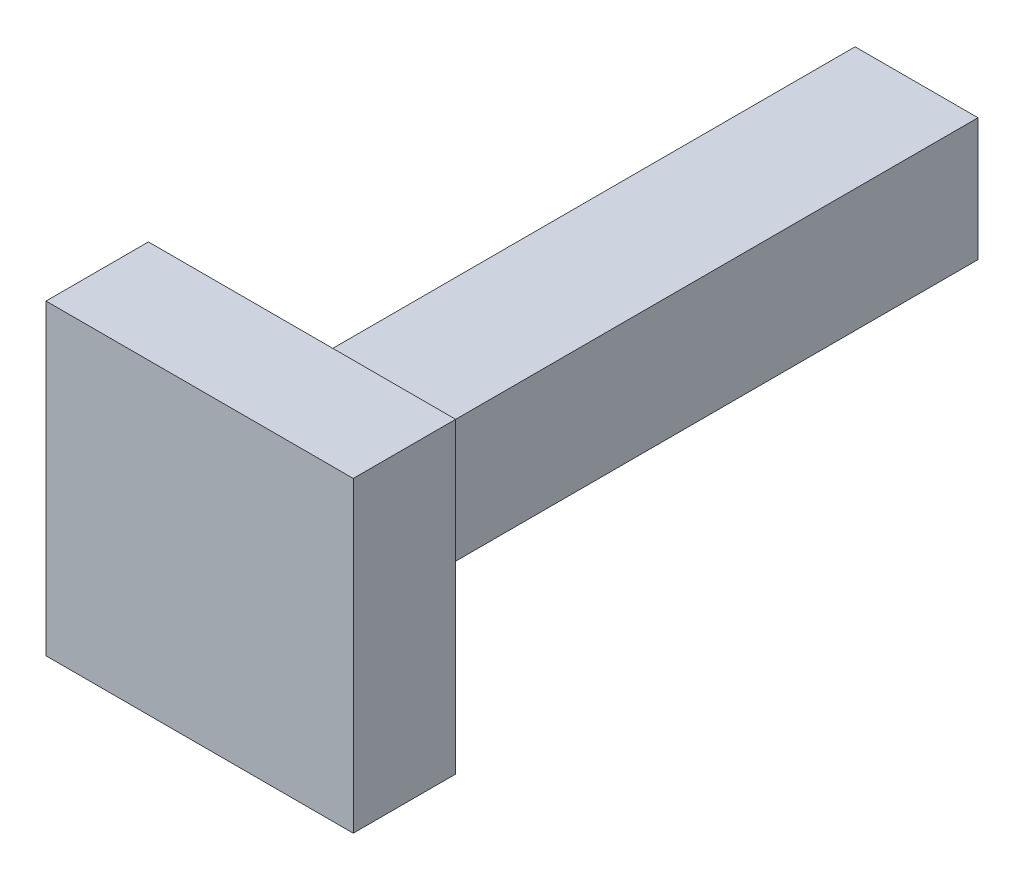
ISO-10303-21;
HEADER;
FILE_DESCRIPTION(('STEP AP214'),'2;1');
FILE_NAME('part.step','',(''),(''),'','','');
FILE_SCHEMA(('AUTOMOTIVE_DESIGN { 1 0 10303 214 1 1 1 1 }'));
ENDSEC;
DATA;
#1=APPLICATION_CONTEXT('core data for automotive mechanical design processes');
#2=APPLICATION_PROTOCOL_DEFINITION('international standard','automotive_design',2000,#1);
#3=PRODUCT_CONTEXT('',#1,'mechanical');
#4=PRODUCT('Part','Part','',(#3));
#5=PRODUCT_RELATED_PRODUCT_CATEGORY('part','',(#4));
#6=PRODUCT_DEFINITION_FORMATION('','',#4);
#7=PRODUCT_DEFINITION_CONTEXT('part definition',#1,'design');
#8=PRODUCT_DEFINITION('design','',#6,#7);
#9=PRODUCT_DEFINITION_SHAPE('','',#8);
#10=(LENGTH_UNIT() NAMED_UNIT(*) SI_UNIT(.MILLI.,.METRE.));
#11=(NAMED_UNIT(*) PLANE_ANGLE_UNIT() SI_UNIT($,.RADIAN.));
#12=(NAMED_UNIT(*) SI_UNIT($,.STERADIAN.) SOLID_ANGLE_UNIT());
#13=UNCERTAINTY_MEASURE_WITH_UNIT(LENGTH_MEASURE(1.E-05),#10,'distance_accuracy_value','');
#14=(GEOMETRIC_REPRESENTATION_CONTEXT(3) GLOBAL_UNCERTAINTY_ASSIGNED_CONTEXT((#13)) GLOBAL_UNIT_ASSIGNED_CONTEXT((#10,
#11,#12)) REPRESENTATION_CONTEXT('',''));
#15=CARTESIAN_POINT('',(0.,0.,0.));
#16=DIRECTION('',(0.,0.,1.));
#17=DIRECTION('',(1.,0.,0.));
#18=AXIS2_PLACEMENT_3D('',#15,#16,#17);
#19=CARTESIAN_POINT('',(0.,0.,60.));
#20=DIRECTION('',(1.,0.,0.));
#21=DIRECTION('',(0.,0.,-1.));
#22=AXIS2_PLACEMENT_3D('',#19,#20,#21);
#23=PLANE('',#22);
#24=DIRECTION('',(0.,-1.,0.));
#25=VECTOR('',#24,1.);
#26=CARTESIAN_POINT('',(0.,0.,0.));
#27=LINE('',#26,#25);
#28=CARTESIAN_POINT('',(0.,12.,0.));
#29=VERTEX_POINT('',#28);
#30=CARTESIAN_POINT('',(0.,0.,0.));
#31=VERTEX_POINT('',#30);
#32=EDGE_CURVE('E131',#29,#31,#27,.T.);
#33=ORIENTED_EDGE('',*,*,#32,.T.);
#34=DIRECTION('',(0.,0.,-1.));
#35=VECTOR('',#34,1.);
#36=CARTESIAN_POINT('',(0.,0.,60.));
#37=LINE('',#36,#35);
#38=CARTESIAN_POINT('',(0.,0.,60.));
#39=VERTEX_POINT('',#38);
#40=EDGE_CURVE('E11',#39,#31,#37,.T.);
#41=ORIENTED_EDGE('',*,*,#40,.F.);
#42=DIRECTION('',(0.,-1.,0.));
#43=VECTOR('',#42,1.);
#44=CARTESIAN_POINT('',(0.,0.,60.));
#45=LINE('',#44,#43);
#46=CARTESIAN_POINT('',(0.,12.,60.));
#47=VERTEX_POINT('',#46);
#48=EDGE_CURVE('E140',#47,#39,#45,.T.);
#49=ORIENTED_EDGE('',*,*,#48,.F.);
#50=DIRECTION('',(0.,0.,-1.));
#51=VECTOR('',#50,1.);
#52=CARTESIAN_POINT('',(0.,12.,60.));
#53=LINE('',#52,#51);
#54=EDGE_CURVE('E149',#47,#29,#53,.T.);
#55=ORIENTED_EDGE('',*,*,#54,.T.);
#56=EDGE_LOOP('',(#33,#41,#49,#55));
#57=FACE_BOUND('',#56,.T.);
#58=ADVANCED_FACE('F33',(#57),#23,.F.);
#59=CARTESIAN_POINT('',(0.,0.,60.));
#60=DIRECTION('',(0.,1.,0.));
#61=DIRECTION('',(0.,0.,1.));
#62=AXIS2_PLACEMENT_3D('',#59,#60,#61);
#63=PLANE('',#62);
#64=DIRECTION('',(1.,0.,0.));
#65=VECTOR('',#64,1.);
#66=CARTESIAN_POINT('',(0.,0.,0.));
#67=LINE('',#66,#65);
#68=CARTESIAN_POINT('',(12.,0.,0.));
#69=VERTEX_POINT('',#68);
#70=EDGE_CURVE('E134',#31,#69,#67,.T.);
#71=ORIENTED_EDGE('',*,*,#70,.T.);
#72=DIRECTION('',(0.,0.,-1.));
#73=VECTOR('',#72,1.);
#74=CARTESIAN_POINT('',(12.,0.,60.));
#75=LINE('',#74,#73);
#76=CARTESIAN_POINT('',(12.,0.,60.));
#77=VERTEX_POINT('',#76);
#78=EDGE_CURVE('E41',#77,#69,#75,.T.);
#79=ORIENTED_EDGE('',*,*,#78,.F.);
#80=DIRECTION('',(1.,0.,0.));
#81=VECTOR('',#80,1.);
#82=CARTESIAN_POINT('',(0.,0.,60.));
#83=LINE('',#82,#81);
#84=EDGE_CURVE('E75',#39,#77,#83,.T.);
#85=ORIENTED_EDGE('',*,*,#84,.F.);
#86=ORIENTED_EDGE('',*,*,#40,.T.);
#87=EDGE_LOOP('',(#71,#79,#85,#86));
#88=FACE_BOUND('',#87,.T.);
#89=ADVANCED_FACE('F175',(#88),#63,.F.);
#90=CARTESIAN_POINT('',(12.,0.,60.));
#91=DIRECTION('',(-1.,0.,0.));
#92=DIRECTION('',(0.,0.,1.));
#93=AXIS2_PLACEMENT_3D('',#90,#91,#92);
#94=PLANE('',#93);
#95=DIRECTION('',(0.,1.,0.));
#96=VECTOR('',#95,1.);
#97=CARTESIAN_POINT('',(12.,0.,0.));
#98=LINE('',#97,#96);
#99=CARTESIAN_POINT('',(12.,12.,0.));
#100=VERTEX_POINT('',#99);
#101=EDGE_CURVE('E65',#69,#100,#98,.T.);
#102=ORIENTED_EDGE('',*,*,#101,.T.);
#103=DIRECTION('',(0.,0.,-1.));
#104=VECTOR('',#103,1.);
#105=CARTESIAN_POINT('',(12.,12.,60.));
#106=LINE('',#105,#104);
#107=CARTESIAN_POINT('',(12.,12.,60.));
#108=VERTEX_POINT('',#107);
#109=EDGE_CURVE('E49',#108,#100,#106,.T.);
#110=ORIENTED_EDGE('',*,*,#109,.F.);
#111=DIRECTION('',(0.,1.,0.));
#112=VECTOR('',#111,1.);
#113=CARTESIAN_POINT('',(12.,0.,60.));
#114=LINE('',#113,#112);
#115=EDGE_CURVE('E144',#77,#108,#114,.T.);
#116=ORIENTED_EDGE('',*,*,#115,.F.);
#117=ORIENTED_EDGE('',*,*,#78,.T.);
#118=EDGE_LOOP('',(#102,#110,#116,#117));
#119=FACE_BOUND('',#118,.T.);
#120=ADVANCED_FACE('F155',(#119),#94,.F.);
#121=CARTESIAN_POINT('',(0.,12.,60.));
#122=DIRECTION('',(0.,-1.,0.));
#123=DIRECTION('',(0.,0.,-1.));
#124=AXIS2_PLACEMENT_3D('',#121,#122,#123);
#125=PLANE('',#124);
#126=DIRECTION('',(-1.,0.,0.));
#127=VECTOR('',#126,1.);
#128=CARTESIAN_POINT('',(0.,12.,0.));
#129=LINE('',#128,#127);
#130=EDGE_CURVE('E70',#100,#29,#129,.T.);
#131=ORIENTED_EDGE('',*,*,#130,.T.);
#132=ORIENTED_EDGE('',*,*,#54,.F.);
#133=DIRECTION('',(-1.,0.,0.));
#134=VECTOR('',#133,1.);
#135=CARTESIAN_POINT('',(0.,12.,60.));
#136=LINE('',#135,#134);
#137=EDGE_CURVE('E147',#108,#47,#136,.T.);
#138=ORIENTED_EDGE('',*,*,#137,.F.);
#139=ORIENTED_EDGE('',*,*,#109,.T.);
#140=EDGE_LOOP('',(#131,#132,#138,#139));
#141=FACE_BOUND('',#140,.T.);
#142=ADVANCED_FACE('F160',(#141),#125,.F.);
#143=CARTESIAN_POINT('',(0.,0.,0.));
#144=DIRECTION('',(0.,0.,-1.));
#145=DIRECTION('',(-1.,0.,0.));
#146=AXIS2_PLACEMENT_3D('',#143,#144,#145);
#147=PLANE('',#146);
#148=ORIENTED_EDGE('',*,*,#32,.F.);
#149=ORIENTED_EDGE('',*,*,#130,.F.);
#150=ORIENTED_EDGE('',*,*,#101,.F.);
#151=ORIENTED_EDGE('',*,*,#70,.F.);
#152=EDGE_LOOP('',(#148,#149,#150,#151));
#153=FACE_BOUND('',#152,.T.);
#154=ADVANCED_FACE('F158',(#153),#147,.T.);
#155=CARTESIAN_POINT('',(0.,0.,60.));
#156=DIRECTION('',(0.,0.,1.));
#157=DIRECTION('',(1.,0.,0.));
#158=AXIS2_PLACEMENT_3D('',#155,#156,#157);
#159=PLANE('',#158);
#160=DIRECTION('',(0.,-1.,0.));
#161=VECTOR('',#160,1.);
#162=CARTESIAN_POINT('',(-9.,-9.,60.));
#163=LINE('',#162,#161);
#164=CARTESIAN_POINT('',(-9.,21.,60.));
#165=VERTEX_POINT('',#164);
#166=CARTESIAN_POINT('',(-9.,-9.,60.));
#167=VERTEX_POINT('',#166);
#168=EDGE_CURVE('E130',#165,#167,#163,.T.);
#169=ORIENTED_EDGE('',*,*,#168,.F.);
#170=DIRECTION('',(-1.,0.,0.));
#171=VECTOR('',#170,1.);
#172=CARTESIAN_POINT('',(21.,21.,60.));
#173=LINE('',#172,#171);
#174=CARTESIAN_POINT('',(21.,21.,60.));
#175=VERTEX_POINT('',#174);
#176=EDGE_CURVE('E126',#175,#165,#173,.T.);
#177=ORIENTED_EDGE('',*,*,#176,.F.);
#178=DIRECTION('',(0.,1.,0.));
#179=VECTOR('',#178,1.);
#180=CARTESIAN_POINT('',(21.,-9.,60.));
#181=LINE('',#180,#179);
#182=CARTESIAN_POINT('',(21.,-9.,60.));
#183=VERTEX_POINT('',#182);
#184=EDGE_CURVE('E202',#183,#175,#181,.T.);
#185=ORIENTED_EDGE('',*,*,#184,.F.);
#186=DIRECTION('',(1.,0.,0.));
#187=VECTOR('',#186,1.);
#188=CARTESIAN_POINT('',(21.,-9.,60.));
#189=LINE('',#188,#187);
#190=EDGE_CURVE('E205',#167,#183,#189,.T.);
#191=ORIENTED_EDGE('',*,*,#190,.F.);
#192=EDGE_LOOP('',(#169,#177,#185,#191));
#193=FACE_BOUND('',#192,.T.);
#194=ORIENTED_EDGE('',*,*,#137,.T.);
#195=ORIENTED_EDGE('',*,*,#48,.T.);
#196=ORIENTED_EDGE('',*,*,#84,.T.);
#197=ORIENTED_EDGE('',*,*,#115,.T.);
#198=EDGE_LOOP('',(#194,#195,#196,#197));
#199=FACE_BOUND('',#198,.T.);
#200=ADVANCED_FACE('F162',(#193,#199),#159,.F.);
#201=CARTESIAN_POINT('',(-9.,-9.,70.));
#202=DIRECTION('',(1.,0.,0.));
#203=DIRECTION('',(0.,0.,-1.));
#204=AXIS2_PLACEMENT_3D('',#201,#202,#203);
#205=PLANE('',#204);
#206=ORIENTED_EDGE('',*,*,#168,.T.);
#207=DIRECTION('',(0.,0.,-1.));
#208=VECTOR('',#207,1.);
#209=CARTESIAN_POINT('',(-9.,-9.,70.));
#210=LINE('',#209,#208);
#211=CARTESIAN_POINT('',(-9.,-9.,70.));
#212=VERTEX_POINT('',#211);
#213=EDGE_CURVE('E110',#212,#167,#210,.T.);
#214=ORIENTED_EDGE('',*,*,#213,.F.);
#215=DIRECTION('',(0.,-1.,0.));
#216=VECTOR('',#215,1.);
#217=CARTESIAN_POINT('',(-9.,-9.,70.));
#218=LINE('',#217,#216);
#219=CARTESIAN_POINT('',(-9.,21.,70.));
#220=VERTEX_POINT('',#219);
#221=EDGE_CURVE('E117',#220,#212,#218,.T.);
#222=ORIENTED_EDGE('',*,*,#221,.F.);
#223=DIRECTION('',(0.,0.,-1.));
#224=VECTOR('',#223,1.);
#225=CARTESIAN_POINT('',(-9.,21.,70.));
#226=LINE('',#225,#224);
#227=EDGE_CURVE('E199',#220,#165,#226,.T.);
#228=ORIENTED_EDGE('',*,*,#227,.T.);
#229=EDGE_LOOP('',(#206,#214,#222,#228));
#230=FACE_BOUND('',#229,.T.);
#231=ADVANCED_FACE('F128',(#230),#205,.F.);
#232=CARTESIAN_POINT('',(21.,-9.,70.));
#233=DIRECTION('',(0.,1.,0.));
#234=DIRECTION('',(-1.,0.,0.));
#235=AXIS2_PLACEMENT_3D('',#232,#233,#234);
#236=PLANE('',#235);
#237=ORIENTED_EDGE('',*,*,#190,.T.);
#238=DIRECTION('',(0.,0.,-1.));
#239=VECTOR('',#238,1.);
#240=CARTESIAN_POINT('',(21.,-9.,70.));
#241=LINE('',#240,#239);
#242=CARTESIAN_POINT('',(21.,-9.,70.));
#243=VERTEX_POINT('',#242);
#244=EDGE_CURVE('E113',#243,#183,#241,.T.);
#245=ORIENTED_EDGE('',*,*,#244,.F.);
#246=DIRECTION('',(1.,0.,0.));
#247=VECTOR('',#246,1.);
#248=CARTESIAN_POINT('',(21.,-9.,70.));
#249=LINE('',#248,#247);
#250=EDGE_CURVE('E106',#212,#243,#249,.T.);
#251=ORIENTED_EDGE('',*,*,#250,.F.);
#252=ORIENTED_EDGE('',*,*,#213,.T.);
#253=EDGE_LOOP('',(#237,#245,#251,#252));
#254=FACE_BOUND('',#253,.T.);
#255=ADVANCED_FACE('F108',(#254),#236,.F.);
#256=CARTESIAN_POINT('',(21.,-9.,70.));
#257=DIRECTION('',(-1.,0.,0.));
#258=DIRECTION('',(0.,0.,1.));
#259=AXIS2_PLACEMENT_3D('',#256,#257,#258);
#260=PLANE('',#259);
#261=ORIENTED_EDGE('',*,*,#184,.T.);
#262=DIRECTION('',(0.,0.,-1.));
#263=VECTOR('',#262,1.);
#264=CARTESIAN_POINT('',(21.,21.,70.));
#265=LINE('',#264,#263);
#266=CARTESIAN_POINT('',(21.,21.,70.));
#267=VERTEX_POINT('',#266);
#268=EDGE_CURVE('E136',#267,#175,#265,.T.);
#269=ORIENTED_EDGE('',*,*,#268,.F.);
#270=DIRECTION('',(0.,1.,0.));
#271=VECTOR('',#270,1.);
#272=CARTESIAN_POINT('',(21.,-9.,70.));
#273=LINE('',#272,#271);
#274=EDGE_CURVE('E116',#243,#267,#273,.T.);
#275=ORIENTED_EDGE('',*,*,#274,.F.);
#276=ORIENTED_EDGE('',*,*,#244,.T.);
#277=EDGE_LOOP('',(#261,#269,#275,#276));
#278=FACE_BOUND('',#277,.T.);
#279=ADVANCED_FACE('F188',(#278),#260,.F.);
#280=CARTESIAN_POINT('',(21.,21.,70.));
#281=DIRECTION('',(0.,-1.,0.));
#282=DIRECTION('',(1.,0.,0.));
#283=AXIS2_PLACEMENT_3D('',#280,#281,#282);
#284=PLANE('',#283);
#285=ORIENTED_EDGE('',*,*,#176,.T.);
#286=ORIENTED_EDGE('',*,*,#227,.F.);
#287=DIRECTION('',(-1.,0.,0.));
#288=VECTOR('',#287,1.);
#289=CARTESIAN_POINT('',(21.,21.,70.));
#290=LINE('',#289,#288);
#291=EDGE_CURVE('E122',#267,#220,#290,.T.);
#292=ORIENTED_EDGE('',*,*,#291,.F.);
#293=ORIENTED_EDGE('',*,*,#268,.T.);
#294=EDGE_LOOP('',(#285,#286,#292,#293));
#295=FACE_BOUND('',#294,.T.);
#296=ADVANCED_FACE('F190',(#295),#284,.F.);
#297=CARTESIAN_POINT('',(0.,0.,70.));
#298=DIRECTION('',(0.,0.,1.));
#299=DIRECTION('',(1.,0.,0.));
#300=AXIS2_PLACEMENT_3D('',#297,#298,#299);
#301=PLANE('',#300);
#302=ORIENTED_EDGE('',*,*,#221,.T.);
#303=ORIENTED_EDGE('',*,*,#250,.T.);
#304=ORIENTED_EDGE('',*,*,#274,.T.);
#305=ORIENTED_EDGE('',*,*,#291,.T.);
#306=EDGE_LOOP('',(#302,#303,#304,#305));
#307=FACE_BOUND('',#306,.T.);
#308=ADVANCED_FACE('F120',(#307),#301,.T.);
#309=CLOSED_SHELL('',(#58,#89,#120,#142,#154,#200,#231,#255,#279,#296,#308));
#310=MANIFOLD_SOLID_BREP('B2',#309);
#311=ADVANCED_BREP_SHAPE_REPRESENTATION('',(#18,#310),#14);
#312=SHAPE_DEFINITION_REPRESENTATION(#9,#311);
ENDSEC;
END-ISO-10303-21;
